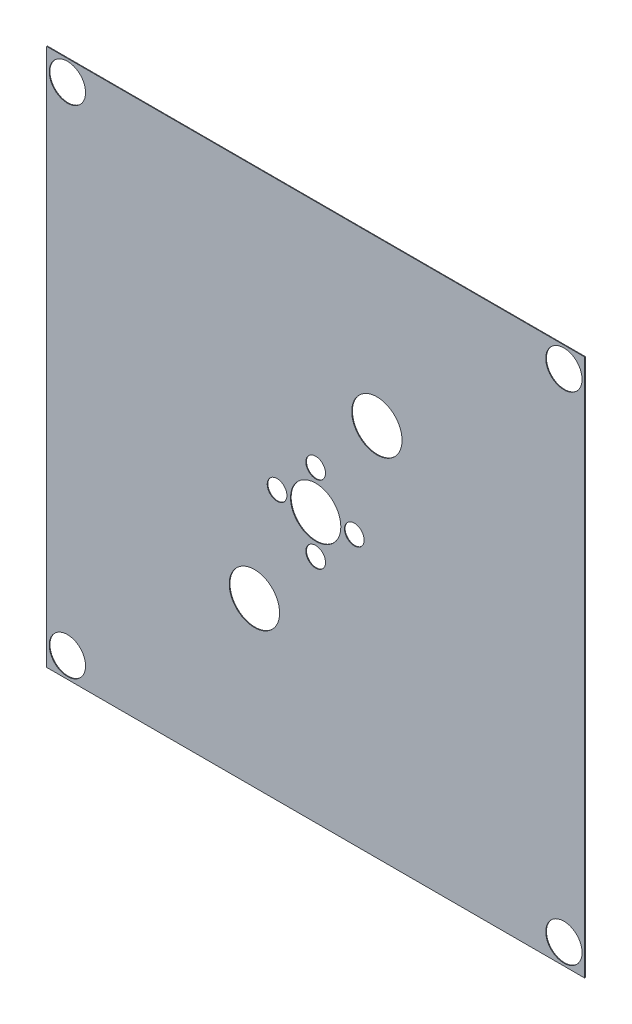
ISO-10303-21;
HEADER;
FILE_DESCRIPTION(('STEP AP214'),'2;1');
FILE_NAME('part.step','',(''),(''),'','','');
FILE_SCHEMA(('AUTOMOTIVE_DESIGN { 1 0 10303 214 1 1 1 1 }'));
ENDSEC;
DATA;
#1=APPLICATION_CONTEXT('core data for automotive mechanical design processes');
#2=APPLICATION_PROTOCOL_DEFINITION('international standard','automotive_design',2000,#1);
#3=PRODUCT_CONTEXT('',#1,'mechanical');
#4=PRODUCT('Part','Part','',(#3));
#5=PRODUCT_RELATED_PRODUCT_CATEGORY('part','',(#4));
#6=PRODUCT_DEFINITION_FORMATION('','',#4);
#7=PRODUCT_DEFINITION_CONTEXT('part definition',#1,'design');
#8=PRODUCT_DEFINITION('design','',#6,#7);
#9=PRODUCT_DEFINITION_SHAPE('','',#8);
#10=(LENGTH_UNIT() NAMED_UNIT(*) SI_UNIT(.MILLI.,.METRE.));
#11=(NAMED_UNIT(*) PLANE_ANGLE_UNIT() SI_UNIT($,.RADIAN.));
#12=(NAMED_UNIT(*) SI_UNIT($,.STERADIAN.) SOLID_ANGLE_UNIT());
#13=UNCERTAINTY_MEASURE_WITH_UNIT(LENGTH_MEASURE(1.E-05),#10,'distance_accuracy_value','');
#14=(GEOMETRIC_REPRESENTATION_CONTEXT(3) GLOBAL_UNCERTAINTY_ASSIGNED_CONTEXT((#13)) GLOBAL_UNIT_ASSIGNED_CONTEXT((#10,
#11,#12)) REPRESENTATION_CONTEXT('',''));
#15=CARTESIAN_POINT('',(0.,0.,0.));
#16=DIRECTION('',(0.,0.,1.));
#17=DIRECTION('',(1.,0.,0.));
#18=AXIS2_PLACEMENT_3D('',#15,#16,#17);
#19=CARTESIAN_POINT('',(975.,975.,2.4));
#20=DIRECTION('',(-1.,0.,0.));
#21=DIRECTION('',(0.,-1.,0.));
#22=AXIS2_PLACEMENT_3D('',#19,#20,#21);
#23=PLANE('',#22);
#24=DIRECTION('',(0.,1.,0.));
#25=VECTOR('',#24,1.);
#26=CARTESIAN_POINT('',(975.,975.,0.));
#27=LINE('',#26,#25);
#28=CARTESIAN_POINT('',(975.,-975.,0.));
#29=VERTEX_POINT('',#28);
#30=CARTESIAN_POINT('',(975.,975.,0.));
#31=VERTEX_POINT('',#30);
#32=EDGE_CURVE('E102',#29,#31,#27,.T.);
#33=ORIENTED_EDGE('',*,*,#32,.T.);
#34=DIRECTION('',(0.,0.,-1.));
#35=VECTOR('',#34,1.);
#36=CARTESIAN_POINT('',(975.,975.,2.4));
#37=LINE('',#36,#35);
#38=CARTESIAN_POINT('',(975.,975.,2.4));
#39=VERTEX_POINT('',#38);
#40=EDGE_CURVE('E11',#39,#31,#37,.T.);
#41=ORIENTED_EDGE('',*,*,#40,.F.);
#42=DIRECTION('',(0.,1.,0.));
#43=VECTOR('',#42,1.);
#44=CARTESIAN_POINT('',(975.,975.,2.4));
#45=LINE('',#44,#43);
#46=CARTESIAN_POINT('',(975.,-975.,2.4));
#47=VERTEX_POINT('',#46);
#48=EDGE_CURVE('E90',#47,#39,#45,.T.);
#49=ORIENTED_EDGE('',*,*,#48,.F.);
#50=DIRECTION('',(0.,0.,-1.));
#51=VECTOR('',#50,1.);
#52=CARTESIAN_POINT('',(975.,-975.,2.4));
#53=LINE('',#52,#51);
#54=EDGE_CURVE('E98',#47,#29,#53,.T.);
#55=ORIENTED_EDGE('',*,*,#54,.T.);
#56=EDGE_LOOP('',(#33,#41,#49,#55));
#57=FACE_BOUND('',#56,.T.);
#58=ADVANCED_FACE('F39',(#57),#23,.F.);
#59=CARTESIAN_POINT('',(-975.,975.,2.4));
#60=DIRECTION('',(0.,-1.,0.));
#61=DIRECTION('',(0.,0.,-1.));
#62=AXIS2_PLACEMENT_3D('',#59,#60,#61);
#63=PLANE('',#62);
#64=DIRECTION('',(-1.,0.,0.));
#65=VECTOR('',#64,1.);
#66=CARTESIAN_POINT('',(-975.,975.,0.));
#67=LINE('',#66,#65);
#68=CARTESIAN_POINT('',(-975.,975.,0.));
#69=VERTEX_POINT('',#68);
#70=EDGE_CURVE('E94',#31,#69,#67,.T.);
#71=ORIENTED_EDGE('',*,*,#70,.T.);
#72=DIRECTION('',(0.,0.,-1.));
#73=VECTOR('',#72,1.);
#74=CARTESIAN_POINT('',(-975.,975.,2.4));
#75=LINE('',#74,#73);
#76=CARTESIAN_POINT('',(-975.,975.,2.4));
#77=VERTEX_POINT('',#76);
#78=EDGE_CURVE('E47',#77,#69,#75,.T.);
#79=ORIENTED_EDGE('',*,*,#78,.F.);
#80=DIRECTION('',(-1.,0.,0.));
#81=VECTOR('',#80,1.);
#82=CARTESIAN_POINT('',(-975.,975.,2.4));
#83=LINE('',#82,#81);
#84=EDGE_CURVE('E85',#39,#77,#83,.T.);
#85=ORIENTED_EDGE('',*,*,#84,.F.);
#86=ORIENTED_EDGE('',*,*,#40,.T.);
#87=EDGE_LOOP('',(#71,#79,#85,#86));
#88=FACE_BOUND('',#87,.T.);
#89=ADVANCED_FACE('F93',(#88),#63,.F.);
#90=CARTESIAN_POINT('',(-975.,975.,2.4));
#91=DIRECTION('',(1.,0.,0.));
#92=DIRECTION('',(0.,1.,0.));
#93=AXIS2_PLACEMENT_3D('',#90,#91,#92);
#94=PLANE('',#93);
#95=DIRECTION('',(0.,-1.,0.));
#96=VECTOR('',#95,1.);
#97=CARTESIAN_POINT('',(-975.,975.,0.));
#98=LINE('',#97,#96);
#99=CARTESIAN_POINT('',(-975.,-975.,0.));
#100=VERTEX_POINT('',#99);
#101=EDGE_CURVE('E72',#69,#100,#98,.T.);
#102=ORIENTED_EDGE('',*,*,#101,.T.);
#103=DIRECTION('',(0.,0.,-1.));
#104=VECTOR('',#103,1.);
#105=CARTESIAN_POINT('',(-975.,-975.,2.4));
#106=LINE('',#105,#104);
#107=CARTESIAN_POINT('',(-975.,-975.,2.4));
#108=VERTEX_POINT('',#107);
#109=EDGE_CURVE('E95',#108,#100,#106,.T.);
#110=ORIENTED_EDGE('',*,*,#109,.F.);
#111=DIRECTION('',(0.,-1.,0.));
#112=VECTOR('',#111,1.);
#113=CARTESIAN_POINT('',(-975.,975.,2.4));
#114=LINE('',#113,#112);
#115=EDGE_CURVE('E88',#77,#108,#114,.T.);
#116=ORIENTED_EDGE('',*,*,#115,.F.);
#117=ORIENTED_EDGE('',*,*,#78,.T.);
#118=EDGE_LOOP('',(#102,#110,#116,#117));
#119=FACE_BOUND('',#118,.T.);
#120=ADVANCED_FACE('F96',(#119),#94,.F.);
#121=CARTESIAN_POINT('',(-975.,-975.,2.4));
#122=DIRECTION('',(0.,1.,0.));
#123=DIRECTION('',(0.,0.,1.));
#124=AXIS2_PLACEMENT_3D('',#121,#122,#123);
#125=PLANE('',#124);
#126=DIRECTION('',(1.,0.,0.));
#127=VECTOR('',#126,1.);
#128=CARTESIAN_POINT('',(-975.,-975.,0.));
#129=LINE('',#128,#127);
#130=EDGE_CURVE('E78',#100,#29,#129,.T.);
#131=ORIENTED_EDGE('',*,*,#130,.T.);
#132=ORIENTED_EDGE('',*,*,#54,.F.);
#133=DIRECTION('',(1.,0.,0.));
#134=VECTOR('',#133,1.);
#135=CARTESIAN_POINT('',(-975.,-975.,2.4));
#136=LINE('',#135,#134);
#137=EDGE_CURVE('E55',#108,#47,#136,.T.);
#138=ORIENTED_EDGE('',*,*,#137,.F.);
#139=ORIENTED_EDGE('',*,*,#109,.T.);
#140=EDGE_LOOP('',(#131,#132,#138,#139));
#141=FACE_BOUND('',#140,.T.);
#142=ADVANCED_FACE('F110',(#141),#125,.F.);
#143=CARTESIAN_POINT('',(0.,0.,2.4));
#144=DIRECTION('',(0.,0.,1.));
#145=DIRECTION('',(1.,0.,0.));
#146=AXIS2_PLACEMENT_3D('',#143,#144,#145);
#147=PLANE('',#146);
#148=CARTESIAN_POINT('',(140.,2.22044604925031E-13,2.4));
#149=DIRECTION('',(0.,0.,1.));
#150=DIRECTION('',(1.,0.,0.));
#151=AXIS2_PLACEMENT_3D('',#148,#149,#150);
#152=CIRCLE('',#151,35.6500000000001);
#153=CARTESIAN_POINT('',(175.65,2.22044604925031E-13,2.4));
#154=VERTEX_POINT('',#153);
#155=EDGE_CURVE('E149',#154,#154,#152,.T.);
#156=ORIENTED_EDGE('',*,*,#155,.F.);
#157=EDGE_LOOP('',(#156));
#158=FACE_BOUND('',#157,.T.);
#159=CARTESIAN_POINT('',(899.999999999999,900.,2.4));
#160=DIRECTION('',(0.,0.,1.));
#161=DIRECTION('',(1.,0.,0.));
#162=AXIS2_PLACEMENT_3D('',#159,#160,#161);
#163=CIRCLE('',#162,65.8000000000003);
#164=CARTESIAN_POINT('',(965.8,900.,2.4));
#165=VERTEX_POINT('',#164);
#166=EDGE_CURVE('E156',#165,#165,#163,.T.);
#167=ORIENTED_EDGE('',*,*,#166,.F.);
#168=EDGE_LOOP('',(#167));
#169=FACE_BOUND('',#168,.T.);
#170=CARTESIAN_POINT('',(1.02258007728804E-13,-140.,2.4));
#171=DIRECTION('',(0.,0.,1.));
#172=DIRECTION('',(-1.,0.,0.));
#173=AXIS2_PLACEMENT_3D('',#170,#171,#172);
#174=CIRCLE('',#173,35.65);
#175=CARTESIAN_POINT('',(-35.6499999999999,-140.,2.4));
#176=VERTEX_POINT('',#175);
#177=EDGE_CURVE('E162',#176,#176,#174,.T.);
#178=ORIENTED_EDGE('',*,*,#177,.F.);
#179=EDGE_LOOP('',(#178));
#180=FACE_BOUND('',#179,.T.);
#181=CARTESIAN_POINT('',(-900.,-900.,2.4));
#182=DIRECTION('',(0.,0.,1.));
#183=DIRECTION('',(-1.,0.,0.));
#184=AXIS2_PLACEMENT_3D('',#181,#182,#183);
#185=CIRCLE('',#184,65.8);
#186=CARTESIAN_POINT('',(-965.8,-900.,2.4));
#187=VERTEX_POINT('',#186);
#188=EDGE_CURVE('E126',#187,#187,#185,.T.);
#189=ORIENTED_EDGE('',*,*,#188,.F.);
#190=EDGE_LOOP('',(#189));
#191=FACE_BOUND('',#190,.T.);
#192=CARTESIAN_POINT('',(-900.,900.,2.4));
#193=DIRECTION('',(0.,0.,1.));
#194=DIRECTION('',(1.,0.,0.));
#195=AXIS2_PLACEMENT_3D('',#192,#193,#194);
#196=CIRCLE('',#195,65.8);
#197=CARTESIAN_POINT('',(-834.2,900.,2.4));
#198=VERTEX_POINT('',#197);
#199=EDGE_CURVE('E125',#198,#198,#196,.T.);
#200=ORIENTED_EDGE('',*,*,#199,.F.);
#201=EDGE_LOOP('',(#200));
#202=FACE_BOUND('',#201,.T.);
#203=CARTESIAN_POINT('',(-222.,-382.,2.4));
#204=DIRECTION('',(0.,0.,1.));
#205=DIRECTION('',(1.,0.,0.));
#206=AXIS2_PLACEMENT_3D('',#203,#204,#205);
#207=CIRCLE('',#206,91.2);
#208=CARTESIAN_POINT('',(-130.8,-382.,2.4));
#209=VERTEX_POINT('',#208);
#210=EDGE_CURVE('E132',#209,#209,#207,.T.);
#211=ORIENTED_EDGE('',*,*,#210,.F.);
#212=EDGE_LOOP('',(#211));
#213=FACE_BOUND('',#212,.T.);
#214=CARTESIAN_POINT('',(222.,382.,2.4));
#215=DIRECTION('',(0.,0.,1.));
#216=DIRECTION('',(1.,0.,0.));
#217=AXIS2_PLACEMENT_3D('',#214,#215,#216);
#218=CIRCLE('',#217,91.2);
#219=CARTESIAN_POINT('',(313.2,382.,2.4));
#220=VERTEX_POINT('',#219);
#221=EDGE_CURVE('E138',#220,#220,#218,.T.);
#222=ORIENTED_EDGE('',*,*,#221,.F.);
#223=EDGE_LOOP('',(#222));
#224=FACE_BOUND('',#223,.T.);
#225=CARTESIAN_POINT('',(1.02258007728804E-13,140.,2.4));
#226=DIRECTION('',(0.,0.,1.));
#227=DIRECTION('',(1.,0.,0.));
#228=AXIS2_PLACEMENT_3D('',#225,#226,#227);
#229=CIRCLE('',#228,35.65);
#230=CARTESIAN_POINT('',(35.6500000000001,140.,2.4));
#231=VERTEX_POINT('',#230);
#232=EDGE_CURVE('E119',#231,#231,#229,.T.);
#233=ORIENTED_EDGE('',*,*,#232,.F.);
#234=EDGE_LOOP('',(#233));
#235=FACE_BOUND('',#234,.T.);
#236=CARTESIAN_POINT('',(-140.,3.33066907387547E-13,2.4));
#237=DIRECTION('',(0.,0.,1.));
#238=DIRECTION('',(-1.,0.,0.));
#239=AXIS2_PLACEMENT_3D('',#236,#237,#238);
#240=CIRCLE('',#239,35.6500000000001);
#241=CARTESIAN_POINT('',(-175.650000000001,3.33066907387547E-13,2.4));
#242=VERTEX_POINT('',#241);
#243=EDGE_CURVE('E150',#242,#242,#240,.T.);
#244=ORIENTED_EDGE('',*,*,#243,.F.);
#245=EDGE_LOOP('',(#244));
#246=FACE_BOUND('',#245,.T.);
#247=CARTESIAN_POINT('',(899.999999999999,-900.,2.4));
#248=DIRECTION('',(0.,0.,1.));
#249=DIRECTION('',(-1.,0.,0.));
#250=AXIS2_PLACEMENT_3D('',#247,#248,#249);
#251=CIRCLE('',#250,65.8000000000003);
#252=CARTESIAN_POINT('',(834.199999999999,-900.,2.4));
#253=VERTEX_POINT('',#252);
#254=EDGE_CURVE('E173',#253,#253,#251,.T.);
#255=ORIENTED_EDGE('',*,*,#254,.F.);
#256=EDGE_LOOP('',(#255));
#257=FACE_BOUND('',#256,.T.);
#258=CARTESIAN_POINT('',(0.,0.,2.4));
#259=DIRECTION('',(0.,0.,1.));
#260=DIRECTION('',(1.,0.,0.));
#261=AXIS2_PLACEMENT_3D('',#258,#259,#260);
#262=CIRCLE('',#261,91.2);
#263=CARTESIAN_POINT('',(91.2,0.,2.4));
#264=VERTEX_POINT('',#263);
#265=EDGE_CURVE('E116',#264,#264,#262,.T.);
#266=ORIENTED_EDGE('',*,*,#265,.F.);
#267=EDGE_LOOP('',(#266));
#268=FACE_BOUND('',#267,.T.);
#269=ORIENTED_EDGE('',*,*,#48,.T.);
#270=ORIENTED_EDGE('',*,*,#84,.T.);
#271=ORIENTED_EDGE('',*,*,#115,.T.);
#272=ORIENTED_EDGE('',*,*,#137,.T.);
#273=EDGE_LOOP('',(#269,#270,#271,#272));
#274=FACE_BOUND('',#273,.T.);
#275=ADVANCED_FACE('F86',(#158,#169,#180,#191,#202,#213,#224,#235,#246,#257,#268,#274),#147,.T.);
#276=CARTESIAN_POINT('',(0.,0.,0.));
#277=DIRECTION('',(0.,0.,1.));
#278=DIRECTION('',(1.,0.,0.));
#279=AXIS2_PLACEMENT_3D('',#276,#277,#278);
#280=PLANE('',#279);
#281=CARTESIAN_POINT('',(140.,2.22044604925031E-13,0.));
#282=DIRECTION('',(0.,0.,1.));
#283=DIRECTION('',(1.,0.,0.));
#284=AXIS2_PLACEMENT_3D('',#281,#282,#283);
#285=CIRCLE('',#284,35.6500000000001);
#286=CARTESIAN_POINT('',(175.65,2.22044604925031E-13,0.));
#287=VERTEX_POINT('',#286);
#288=EDGE_CURVE('E146',#287,#287,#285,.T.);
#289=ORIENTED_EDGE('',*,*,#288,.T.);
#290=EDGE_LOOP('',(#289));
#291=FACE_BOUND('',#290,.T.);
#292=CARTESIAN_POINT('',(899.999999999999,900.,0.));
#293=DIRECTION('',(0.,0.,1.));
#294=DIRECTION('',(1.,0.,0.));
#295=AXIS2_PLACEMENT_3D('',#292,#293,#294);
#296=CIRCLE('',#295,65.8000000000003);
#297=CARTESIAN_POINT('',(965.8,900.,0.));
#298=VERTEX_POINT('',#297);
#299=EDGE_CURVE('E153',#298,#298,#296,.T.);
#300=ORIENTED_EDGE('',*,*,#299,.T.);
#301=EDGE_LOOP('',(#300));
#302=FACE_BOUND('',#301,.T.);
#303=CARTESIAN_POINT('',(1.02258007728804E-13,-140.,0.));
#304=DIRECTION('',(0.,0.,1.));
#305=DIRECTION('',(-1.,0.,0.));
#306=AXIS2_PLACEMENT_3D('',#303,#304,#305);
#307=CIRCLE('',#306,35.65);
#308=CARTESIAN_POINT('',(-35.6499999999999,-140.,0.));
#309=VERTEX_POINT('',#308);
#310=EDGE_CURVE('E159',#309,#309,#307,.T.);
#311=ORIENTED_EDGE('',*,*,#310,.T.);
#312=EDGE_LOOP('',(#311));
#313=FACE_BOUND('',#312,.T.);
#314=CARTESIAN_POINT('',(-900.,-900.,0.));
#315=DIRECTION('',(0.,0.,1.));
#316=DIRECTION('',(-1.,0.,0.));
#317=AXIS2_PLACEMENT_3D('',#314,#315,#316);
#318=CIRCLE('',#317,65.8);
#319=CARTESIAN_POINT('',(-965.8,-900.,0.));
#320=VERTEX_POINT('',#319);
#321=EDGE_CURVE('E165',#320,#320,#318,.T.);
#322=ORIENTED_EDGE('',*,*,#321,.T.);
#323=EDGE_LOOP('',(#322));
#324=FACE_BOUND('',#323,.T.);
#325=CARTESIAN_POINT('',(-900.,900.,0.));
#326=DIRECTION('',(0.,0.,1.));
#327=DIRECTION('',(1.,0.,0.));
#328=AXIS2_PLACEMENT_3D('',#325,#326,#327);
#329=CIRCLE('',#328,65.8);
#330=CARTESIAN_POINT('',(-834.2,900.,0.));
#331=VERTEX_POINT('',#330);
#332=EDGE_CURVE('E122',#331,#331,#329,.T.);
#333=ORIENTED_EDGE('',*,*,#332,.T.);
#334=EDGE_LOOP('',(#333));
#335=FACE_BOUND('',#334,.T.);
#336=CARTESIAN_POINT('',(-222.,-382.,0.));
#337=DIRECTION('',(0.,0.,1.));
#338=DIRECTION('',(1.,0.,0.));
#339=AXIS2_PLACEMENT_3D('',#336,#337,#338);
#340=CIRCLE('',#339,91.2);
#341=CARTESIAN_POINT('',(-130.8,-382.,0.));
#342=VERTEX_POINT('',#341);
#343=EDGE_CURVE('E129',#342,#342,#340,.T.);
#344=ORIENTED_EDGE('',*,*,#343,.T.);
#345=EDGE_LOOP('',(#344));
#346=FACE_BOUND('',#345,.T.);
#347=CARTESIAN_POINT('',(222.,382.,0.));
#348=DIRECTION('',(0.,0.,1.));
#349=DIRECTION('',(1.,0.,0.));
#350=AXIS2_PLACEMENT_3D('',#347,#348,#349);
#351=CIRCLE('',#350,91.2);
#352=CARTESIAN_POINT('',(313.2,382.,0.));
#353=VERTEX_POINT('',#352);
#354=EDGE_CURVE('E135',#353,#353,#351,.T.);
#355=ORIENTED_EDGE('',*,*,#354,.T.);
#356=EDGE_LOOP('',(#355));
#357=FACE_BOUND('',#356,.T.);
#358=CARTESIAN_POINT('',(1.02258007728804E-13,140.,0.));
#359=DIRECTION('',(0.,0.,1.));
#360=DIRECTION('',(1.,0.,0.));
#361=AXIS2_PLACEMENT_3D('',#358,#359,#360);
#362=CIRCLE('',#361,35.65);
#363=CARTESIAN_POINT('',(35.6500000000001,140.,0.));
#364=VERTEX_POINT('',#363);
#365=EDGE_CURVE('E141',#364,#364,#362,.T.);
#366=ORIENTED_EDGE('',*,*,#365,.T.);
#367=EDGE_LOOP('',(#366));
#368=FACE_BOUND('',#367,.T.);
#369=CARTESIAN_POINT('',(-140.,3.33066907387547E-13,0.));
#370=DIRECTION('',(0.,0.,1.));
#371=DIRECTION('',(-1.,0.,0.));
#372=AXIS2_PLACEMENT_3D('',#369,#370,#371);
#373=CIRCLE('',#372,35.6500000000001);
#374=CARTESIAN_POINT('',(-175.650000000001,3.33066907387547E-13,0.));
#375=VERTEX_POINT('',#374);
#376=EDGE_CURVE('E176',#375,#375,#373,.T.);
#377=ORIENTED_EDGE('',*,*,#376,.T.);
#378=EDGE_LOOP('',(#377));
#379=FACE_BOUND('',#378,.T.);
#380=CARTESIAN_POINT('',(899.999999999999,-900.,0.));
#381=DIRECTION('',(0.,0.,1.));
#382=DIRECTION('',(-1.,0.,0.));
#383=AXIS2_PLACEMENT_3D('',#380,#381,#382);
#384=CIRCLE('',#383,65.8000000000003);
#385=CARTESIAN_POINT('',(834.199999999999,-900.,0.));
#386=VERTEX_POINT('',#385);
#387=EDGE_CURVE('E170',#386,#386,#384,.T.);
#388=ORIENTED_EDGE('',*,*,#387,.T.);
#389=EDGE_LOOP('',(#388));
#390=FACE_BOUND('',#389,.T.);
#391=CARTESIAN_POINT('',(0.,0.,0.));
#392=DIRECTION('',(0.,0.,1.));
#393=DIRECTION('',(1.,0.,0.));
#394=AXIS2_PLACEMENT_3D('',#391,#392,#393);
#395=CIRCLE('',#394,91.2);
#396=CARTESIAN_POINT('',(91.2,0.,0.));
#397=VERTEX_POINT('',#396);
#398=EDGE_CURVE('E105',#397,#397,#395,.T.);
#399=ORIENTED_EDGE('',*,*,#398,.T.);
#400=EDGE_LOOP('',(#399));
#401=FACE_BOUND('',#400,.T.);
#402=ORIENTED_EDGE('',*,*,#32,.F.);
#403=ORIENTED_EDGE('',*,*,#130,.F.);
#404=ORIENTED_EDGE('',*,*,#101,.F.);
#405=ORIENTED_EDGE('',*,*,#70,.F.);
#406=EDGE_LOOP('',(#402,#403,#404,#405));
#407=FACE_BOUND('',#406,.T.);
#408=ADVANCED_FACE('F113',(#291,#302,#313,#324,#335,#346,#357,#368,#379,#390,#401,#407),#280,.F.);
#409=CARTESIAN_POINT('',(0.,0.,0.));
#410=DIRECTION('',(0.,0.,1.));
#411=DIRECTION('',(1.,0.,0.));
#412=AXIS2_PLACEMENT_3D('',#409,#410,#411);
#413=CYLINDRICAL_SURFACE('',#412,91.2);
#414=ORIENTED_EDGE('',*,*,#398,.F.);
#415=EDGE_LOOP('',(#414));
#416=FACE_BOUND('',#415,.T.);
#417=ORIENTED_EDGE('',*,*,#265,.T.);
#418=EDGE_LOOP('',(#417));
#419=FACE_BOUND('',#418,.T.);
#420=ADVANCED_FACE('F192',(#416,#419),#413,.F.);
#421=CARTESIAN_POINT('',(899.999999999999,-900.,0.));
#422=DIRECTION('',(0.,0.,1.));
#423=DIRECTION('',(1.,0.,0.));
#424=AXIS2_PLACEMENT_3D('',#421,#422,#423);
#425=CYLINDRICAL_SURFACE('',#424,65.8000000000003);
#426=ORIENTED_EDGE('',*,*,#387,.F.);
#427=EDGE_LOOP('',(#426));
#428=FACE_BOUND('',#427,.T.);
#429=ORIENTED_EDGE('',*,*,#254,.T.);
#430=EDGE_LOOP('',(#429));
#431=FACE_BOUND('',#430,.T.);
#432=ADVANCED_FACE('F194',(#428,#431),#425,.F.);
#433=CARTESIAN_POINT('',(-140.,3.33066907387547E-13,0.));
#434=DIRECTION('',(0.,0.,1.));
#435=DIRECTION('',(1.,0.,0.));
#436=AXIS2_PLACEMENT_3D('',#433,#434,#435);
#437=CYLINDRICAL_SURFACE('',#436,35.6500000000001);
#438=ORIENTED_EDGE('',*,*,#376,.F.);
#439=EDGE_LOOP('',(#438));
#440=FACE_BOUND('',#439,.T.);
#441=ORIENTED_EDGE('',*,*,#243,.T.);
#442=EDGE_LOOP('',(#441));
#443=FACE_BOUND('',#442,.T.);
#444=ADVANCED_FACE('F182',(#440,#443),#437,.F.);
#445=CARTESIAN_POINT('',(1.02258007728804E-13,140.,0.));
#446=DIRECTION('',(0.,0.,1.));
#447=DIRECTION('',(1.,0.,0.));
#448=AXIS2_PLACEMENT_3D('',#445,#446,#447);
#449=CYLINDRICAL_SURFACE('',#448,35.65);
#450=ORIENTED_EDGE('',*,*,#365,.F.);
#451=EDGE_LOOP('',(#450));
#452=FACE_BOUND('',#451,.T.);
#453=ORIENTED_EDGE('',*,*,#232,.T.);
#454=EDGE_LOOP('',(#453));
#455=FACE_BOUND('',#454,.T.);
#456=ADVANCED_FACE('F251',(#452,#455),#449,.F.);
#457=CARTESIAN_POINT('',(222.,382.,0.));
#458=DIRECTION('',(0.,0.,1.));
#459=DIRECTION('',(1.,0.,0.));
#460=AXIS2_PLACEMENT_3D('',#457,#458,#459);
#461=CYLINDRICAL_SURFACE('',#460,91.2);
#462=ORIENTED_EDGE('',*,*,#354,.F.);
#463=EDGE_LOOP('',(#462));
#464=FACE_BOUND('',#463,.T.);
#465=ORIENTED_EDGE('',*,*,#221,.T.);
#466=EDGE_LOOP('',(#465));
#467=FACE_BOUND('',#466,.T.);
#468=ADVANCED_FACE('F262',(#464,#467),#461,.F.);
#469=CARTESIAN_POINT('',(-222.,-382.,0.));
#470=DIRECTION('',(0.,0.,1.));
#471=DIRECTION('',(1.,0.,0.));
#472=AXIS2_PLACEMENT_3D('',#469,#470,#471);
#473=CYLINDRICAL_SURFACE('',#472,91.2);
#474=ORIENTED_EDGE('',*,*,#343,.F.);
#475=EDGE_LOOP('',(#474));
#476=FACE_BOUND('',#475,.T.);
#477=ORIENTED_EDGE('',*,*,#210,.T.);
#478=EDGE_LOOP('',(#477));
#479=FACE_BOUND('',#478,.T.);
#480=ADVANCED_FACE('F273',(#476,#479),#473,.F.);
#481=CARTESIAN_POINT('',(-900.,900.,0.));
#482=DIRECTION('',(0.,0.,1.));
#483=DIRECTION('',(1.,0.,0.));
#484=AXIS2_PLACEMENT_3D('',#481,#482,#483);
#485=CYLINDRICAL_SURFACE('',#484,65.8);
#486=ORIENTED_EDGE('',*,*,#332,.F.);
#487=EDGE_LOOP('',(#486));
#488=FACE_BOUND('',#487,.T.);
#489=ORIENTED_EDGE('',*,*,#199,.T.);
#490=EDGE_LOOP('',(#489));
#491=FACE_BOUND('',#490,.T.);
#492=ADVANCED_FACE('F284',(#488,#491),#485,.F.);
#493=CARTESIAN_POINT('',(-900.,-900.,0.));
#494=DIRECTION('',(0.,0.,1.));
#495=DIRECTION('',(1.,0.,0.));
#496=AXIS2_PLACEMENT_3D('',#493,#494,#495);
#497=CYLINDRICAL_SURFACE('',#496,65.8);
#498=ORIENTED_EDGE('',*,*,#321,.F.);
#499=EDGE_LOOP('',(#498));
#500=FACE_BOUND('',#499,.T.);
#501=ORIENTED_EDGE('',*,*,#188,.T.);
#502=EDGE_LOOP('',(#501));
#503=FACE_BOUND('',#502,.T.);
#504=ADVANCED_FACE('F295',(#500,#503),#497,.F.);
#505=CARTESIAN_POINT('',(1.02258007728804E-13,-140.,0.));
#506=DIRECTION('',(0.,0.,1.));
#507=DIRECTION('',(1.,0.,0.));
#508=AXIS2_PLACEMENT_3D('',#505,#506,#507);
#509=CYLINDRICAL_SURFACE('',#508,35.65);
#510=ORIENTED_EDGE('',*,*,#310,.F.);
#511=EDGE_LOOP('',(#510));
#512=FACE_BOUND('',#511,.T.);
#513=ORIENTED_EDGE('',*,*,#177,.T.);
#514=EDGE_LOOP('',(#513));
#515=FACE_BOUND('',#514,.T.);
#516=ADVANCED_FACE('F305',(#512,#515),#509,.F.);
#517=CARTESIAN_POINT('',(899.999999999999,900.,0.));
#518=DIRECTION('',(0.,0.,1.));
#519=DIRECTION('',(1.,0.,0.));
#520=AXIS2_PLACEMENT_3D('',#517,#518,#519);
#521=CYLINDRICAL_SURFACE('',#520,65.8000000000003);
#522=ORIENTED_EDGE('',*,*,#299,.F.);
#523=EDGE_LOOP('',(#522));
#524=FACE_BOUND('',#523,.T.);
#525=ORIENTED_EDGE('',*,*,#166,.T.);
#526=EDGE_LOOP('',(#525));
#527=FACE_BOUND('',#526,.T.);
#528=ADVANCED_FACE('F316',(#524,#527),#521,.F.);
#529=CARTESIAN_POINT('',(140.,2.22044604925031E-13,0.));
#530=DIRECTION('',(0.,0.,1.));
#531=DIRECTION('',(1.,0.,0.));
#532=AXIS2_PLACEMENT_3D('',#529,#530,#531);
#533=CYLINDRICAL_SURFACE('',#532,35.6500000000001);
#534=ORIENTED_EDGE('',*,*,#288,.F.);
#535=EDGE_LOOP('',(#534));
#536=FACE_BOUND('',#535,.T.);
#537=ORIENTED_EDGE('',*,*,#155,.T.);
#538=EDGE_LOOP('',(#537));
#539=FACE_BOUND('',#538,.T.);
#540=ADVANCED_FACE('F327',(#536,#539),#533,.F.);
#541=CLOSED_SHELL('',(#58,#89,#120,#142,#275,#408,#420,#432,#444,#456,#468,#480,#492,#504,#516,
#528,#540));
#542=MANIFOLD_SOLID_BREP('B2',#541);
#543=ADVANCED_BREP_SHAPE_REPRESENTATION('',(#18,#542),#14);
#544=SHAPE_DEFINITION_REPRESENTATION(#9,#543);
ENDSEC;
END-ISO-10303-21;
